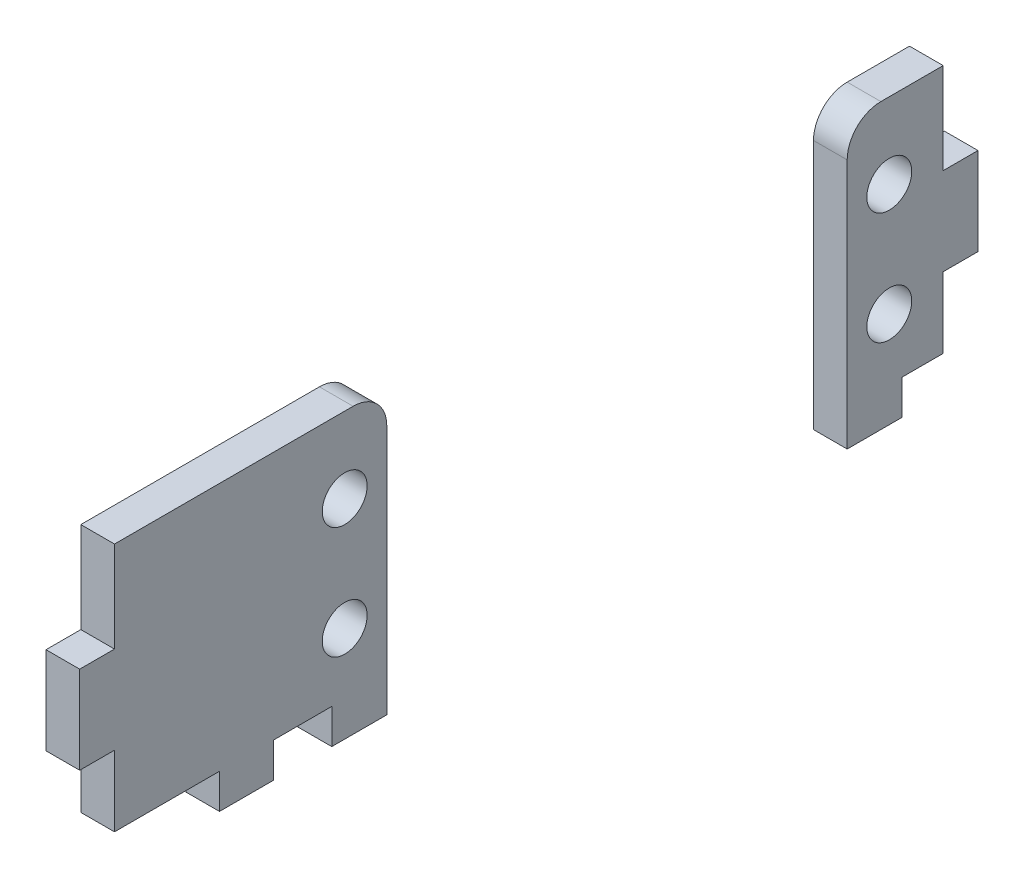
ISO-10303-21;
HEADER;
FILE_DESCRIPTION(('STEP AP214'),'2;1');
FILE_NAME('part.step','',(''),(''),'','','');
FILE_SCHEMA(('AUTOMOTIVE_DESIGN { 1 0 10303 214 1 1 1 1 }'));
ENDSEC;
DATA;
#1=APPLICATION_CONTEXT('core data for automotive mechanical design processes');
#2=APPLICATION_PROTOCOL_DEFINITION('international standard','automotive_design',2000,#1);
#3=PRODUCT_CONTEXT('',#1,'mechanical');
#4=PRODUCT('Part','Part','',(#3));
#5=PRODUCT_RELATED_PRODUCT_CATEGORY('part','',(#4));
#6=PRODUCT_DEFINITION_FORMATION('','',#4);
#7=PRODUCT_DEFINITION_CONTEXT('part definition',#1,'design');
#8=PRODUCT_DEFINITION('design','',#6,#7);
#9=PRODUCT_DEFINITION_SHAPE('','',#8);
#10=(LENGTH_UNIT() NAMED_UNIT(*) SI_UNIT(.MILLI.,.METRE.));
#11=(NAMED_UNIT(*) PLANE_ANGLE_UNIT() SI_UNIT($,.RADIAN.));
#12=(NAMED_UNIT(*) SI_UNIT($,.STERADIAN.) SOLID_ANGLE_UNIT());
#13=UNCERTAINTY_MEASURE_WITH_UNIT(LENGTH_MEASURE(1.E-05),#10,'distance_accuracy_value','');
#14=(GEOMETRIC_REPRESENTATION_CONTEXT(3) GLOBAL_UNCERTAINTY_ASSIGNED_CONTEXT((#13)) GLOBAL_UNIT_ASSIGNED_CONTEXT((#10,
#11,#12)) REPRESENTATION_CONTEXT('',''));
#15=CARTESIAN_POINT('',(0.,0.,0.));
#16=DIRECTION('',(0.,0.,1.));
#17=DIRECTION('',(1.,0.,0.));
#18=AXIS2_PLACEMENT_3D('',#15,#16,#17);
#19=CARTESIAN_POINT('',(-3.00000000000004,-25.3,-80.));
#20=DIRECTION('',(0.,-1.,0.));
#21=DIRECTION('',(0.,0.,-1.));
#22=AXIS2_PLACEMENT_3D('',#19,#20,#21);
#23=PLANE('',#22);
#24=DIRECTION('',(-1.,0.,0.));
#25=VECTOR('',#24,1.);
#26=CARTESIAN_POINT('',(-3.00000000000004,-25.3,-73.25));
#27=LINE('',#26,#25);
#28=CARTESIAN_POINT('',(0.,-25.3,-73.25));
#29=VERTEX_POINT('',#28);
#30=CARTESIAN_POINT('',(-3.00000000000004,-25.3,-73.25));
#31=VERTEX_POINT('',#30);
#32=EDGE_CURVE('E133',#29,#31,#27,.T.);
#33=ORIENTED_EDGE('',*,*,#32,.F.);
#34=DIRECTION('',(0.,0.,-1.));
#35=VECTOR('',#34,1.);
#36=CARTESIAN_POINT('',(0.,-25.3,-80.));
#37=LINE('',#36,#35);
#38=CARTESIAN_POINT('',(0.,-25.3,-68.35));
#39=VERTEX_POINT('',#38);
#40=EDGE_CURVE('E195',#39,#29,#37,.T.);
#41=ORIENTED_EDGE('',*,*,#40,.F.);
#42=DIRECTION('',(1.,0.,0.));
#43=VECTOR('',#42,1.);
#44=CARTESIAN_POINT('',(-3.00000000000004,-25.3,-68.35));
#45=LINE('',#44,#43);
#46=CARTESIAN_POINT('',(-3.00000000000004,-25.3,-68.35));
#47=VERTEX_POINT('',#46);
#48=EDGE_CURVE('E207',#47,#39,#45,.T.);
#49=ORIENTED_EDGE('',*,*,#48,.F.);
#50=DIRECTION('',(0.,0.,-1.));
#51=VECTOR('',#50,1.);
#52=CARTESIAN_POINT('',(-3.00000000000004,-25.3,-80.));
#53=LINE('',#52,#51);
#54=EDGE_CURVE('E198',#47,#31,#53,.T.);
#55=ORIENTED_EDGE('',*,*,#54,.T.);
#56=EDGE_LOOP('',(#33,#41,#49,#55));
#57=FACE_BOUND('',#56,.T.);
#58=ADVANCED_FACE('F43',(#57),#23,.T.);
#59=CARTESIAN_POINT('',(-3.00000000000004,0.,-68.35));
#60=DIRECTION('',(0.,0.,1.));
#61=DIRECTION('',(1.,0.,0.));
#62=AXIS2_PLACEMENT_3D('',#59,#60,#61);
#63=PLANE('',#62);
#64=DIRECTION('',(0.,-1.,0.));
#65=VECTOR('',#64,1.);
#66=CARTESIAN_POINT('',(0.,0.,-68.35));
#67=LINE('',#66,#65);
#68=CARTESIAN_POINT('',(0.,-3.,-68.35));
#69=VERTEX_POINT('',#68);
#70=EDGE_CURVE('E202',#69,#39,#67,.T.);
#71=ORIENTED_EDGE('',*,*,#70,.F.);
#72=DIRECTION('',(1.,0.,0.));
#73=VECTOR('',#72,1.);
#74=CARTESIAN_POINT('',(-3.00000000000004,-3.,-68.35));
#75=LINE('',#74,#73);
#76=CARTESIAN_POINT('',(-3.00000000000004,-3.,-68.35));
#77=VERTEX_POINT('',#76);
#78=EDGE_CURVE('E51',#69,#77,#75,.F.);
#79=ORIENTED_EDGE('',*,*,#78,.T.);
#80=DIRECTION('',(0.,-1.,0.));
#81=VECTOR('',#80,1.);
#82=CARTESIAN_POINT('',(-3.00000000000004,0.,-68.35));
#83=LINE('',#82,#81);
#84=EDGE_CURVE('E205',#77,#47,#83,.T.);
#85=ORIENTED_EDGE('',*,*,#84,.T.);
#86=ORIENTED_EDGE('',*,*,#48,.T.);
#87=EDGE_LOOP('',(#71,#79,#85,#86));
#88=FACE_BOUND('',#87,.T.);
#89=ADVANCED_FACE('F255',(#88),#63,.T.);
#90=CARTESIAN_POINT('',(-3.00000000000004,0.,-68.35));
#91=DIRECTION('',(0.,1.,0.));
#92=DIRECTION('',(0.,0.,1.));
#93=AXIS2_PLACEMENT_3D('',#90,#91,#92);
#94=PLANE('',#93);
#95=DIRECTION('',(0.,0.,1.));
#96=VECTOR('',#95,1.);
#97=CARTESIAN_POINT('',(-3.00000000000004,0.,-68.35));
#98=LINE('',#97,#96);
#99=CARTESIAN_POINT('',(-3.00000000000004,0.,-76.9));
#100=VERTEX_POINT('',#99);
#101=CARTESIAN_POINT('',(-3.00000000000004,0.,-71.35));
#102=VERTEX_POINT('',#101);
#103=EDGE_CURVE('E148',#100,#102,#98,.T.);
#104=ORIENTED_EDGE('',*,*,#103,.T.);
#105=DIRECTION('',(1.,0.,0.));
#106=VECTOR('',#105,1.);
#107=CARTESIAN_POINT('',(-3.00000000000004,0.,-71.35));
#108=LINE('',#107,#106);
#109=CARTESIAN_POINT('',(0.,0.,-71.35));
#110=VERTEX_POINT('',#109);
#111=EDGE_CURVE('E222',#102,#110,#108,.T.);
#112=ORIENTED_EDGE('',*,*,#111,.T.);
#113=DIRECTION('',(0.,0.,1.));
#114=VECTOR('',#113,1.);
#115=CARTESIAN_POINT('',(0.,0.,-68.35));
#116=LINE('',#115,#114);
#117=CARTESIAN_POINT('',(0.,0.,-76.9));
#118=VERTEX_POINT('',#117);
#119=EDGE_CURVE('E213',#118,#110,#116,.T.);
#120=ORIENTED_EDGE('',*,*,#119,.F.);
#121=DIRECTION('',(1.,0.,0.));
#122=VECTOR('',#121,1.);
#123=CARTESIAN_POINT('',(-3.00000000000004,0.,-76.9));
#124=LINE('',#123,#122);
#125=EDGE_CURVE('E182',#100,#118,#124,.T.);
#126=ORIENTED_EDGE('',*,*,#125,.F.);
#127=EDGE_LOOP('',(#104,#112,#120,#126));
#128=FACE_BOUND('',#127,.T.);
#129=ADVANCED_FACE('F228',(#128),#94,.T.);
#130=CARTESIAN_POINT('',(-3.00000000000004,0.,-80.));
#131=DIRECTION('',(0.,0.,-1.));
#132=DIRECTION('',(-1.,0.,0.));
#133=AXIS2_PLACEMENT_3D('',#130,#131,#132);
#134=PLANE('',#133);
#135=DIRECTION('',(-1.,0.,0.));
#136=VECTOR('',#135,1.);
#137=CARTESIAN_POINT('',(-3.00000000000004,-8.10000000000002,-80.));
#138=LINE('',#137,#136);
#139=CARTESIAN_POINT('',(0.,-8.10000000000002,-80.));
#140=VERTEX_POINT('',#139);
#141=CARTESIAN_POINT('',(-3.00000000000004,-8.10000000000002,-80.));
#142=VERTEX_POINT('',#141);
#143=EDGE_CURVE('E139',#140,#142,#138,.T.);
#144=ORIENTED_EDGE('',*,*,#143,.F.);
#145=DIRECTION('',(0.,1.,0.));
#146=VECTOR('',#145,1.);
#147=CARTESIAN_POINT('',(0.,0.,-80.));
#148=LINE('',#147,#146);
#149=CARTESIAN_POINT('',(0.,-15.9,-80.));
#150=VERTEX_POINT('',#149);
#151=EDGE_CURVE('E210',#150,#140,#148,.T.);
#152=ORIENTED_EDGE('',*,*,#151,.F.);
#153=DIRECTION('',(1.,0.,0.));
#154=VECTOR('',#153,1.);
#155=CARTESIAN_POINT('',(-3.00000000000004,-15.9,-80.));
#156=LINE('',#155,#154);
#157=CARTESIAN_POINT('',(-3.00000000000004,-15.9,-80.));
#158=VERTEX_POINT('',#157);
#159=EDGE_CURVE('E180',#158,#150,#156,.T.);
#160=ORIENTED_EDGE('',*,*,#159,.F.);
#161=DIRECTION('',(0.,1.,0.));
#162=VECTOR('',#161,1.);
#163=CARTESIAN_POINT('',(-3.00000000000004,0.,-80.));
#164=LINE('',#163,#162);
#165=EDGE_CURVE('E201',#158,#142,#164,.T.);
#166=ORIENTED_EDGE('',*,*,#165,.T.);
#167=EDGE_LOOP('',(#144,#152,#160,#166));
#168=FACE_BOUND('',#167,.T.);
#169=ADVANCED_FACE('F236',(#168),#134,.T.);
#170=CARTESIAN_POINT('',(-3.00000000000004,0.,0.));
#171=DIRECTION('',(1.,0.,0.));
#172=DIRECTION('',(0.,0.,-1.));
#173=AXIS2_PLACEMENT_3D('',#170,#171,#172);
#174=PLANE('',#173);
#175=ORIENTED_EDGE('',*,*,#84,.F.);
#176=CARTESIAN_POINT('',(-3.00000000000004,-3.,-71.35));
#177=DIRECTION('',(1.,0.,0.));
#178=DIRECTION('',(0.,0.,-1.));
#179=AXIS2_PLACEMENT_3D('',#176,#177,#178);
#180=CIRCLE('',#179,3.);
#181=EDGE_CURVE('E12',#77,#102,#180,.F.);
#182=ORIENTED_EDGE('',*,*,#181,.T.);
#183=ORIENTED_EDGE('',*,*,#103,.F.);
#184=DIRECTION('',(0.,-1.,0.));
#185=VECTOR('',#184,1.);
#186=CARTESIAN_POINT('',(-3.00000000000004,0.100000000000007,-76.9));
#187=LINE('',#186,#185);
#188=CARTESIAN_POINT('',(-3.00000000000004,-8.10000000000002,-76.9));
#189=VERTEX_POINT('',#188);
#190=EDGE_CURVE('E127',#100,#189,#187,.T.);
#191=ORIENTED_EDGE('',*,*,#190,.T.);
#192=DIRECTION('',(0.,0.,-1.));
#193=VECTOR('',#192,1.);
#194=CARTESIAN_POINT('',(-3.00000000000004,-8.10000000000002,-76.9));
#195=LINE('',#194,#193);
#196=EDGE_CURVE('E134',#189,#142,#195,.T.);
#197=ORIENTED_EDGE('',*,*,#196,.T.);
#198=ORIENTED_EDGE('',*,*,#165,.F.);
#199=DIRECTION('',(0.,0.,1.));
#200=VECTOR('',#199,1.);
#201=CARTESIAN_POINT('',(-3.00000000000004,-15.9,-80.1000000000001));
#202=LINE('',#201,#200);
#203=CARTESIAN_POINT('',(-3.00000000000004,-15.9,-76.9));
#204=VERTEX_POINT('',#203);
#205=EDGE_CURVE('E154',#158,#204,#202,.T.);
#206=ORIENTED_EDGE('',*,*,#205,.T.);
#207=DIRECTION('',(0.,-1.,0.));
#208=VECTOR('',#207,1.);
#209=CARTESIAN_POINT('',(-3.00000000000004,-15.9,-76.9));
#210=LINE('',#209,#208);
#211=CARTESIAN_POINT('',(-3.00000000000004,-22.2,-76.9));
#212=VERTEX_POINT('',#211);
#213=EDGE_CURVE('E157',#204,#212,#210,.T.);
#214=ORIENTED_EDGE('',*,*,#213,.T.);
#215=DIRECTION('',(0.,0.,1.));
#216=VECTOR('',#215,1.);
#217=CARTESIAN_POINT('',(-3.00000000000004,-22.2,-76.9));
#218=LINE('',#217,#216);
#219=CARTESIAN_POINT('',(-3.00000000000004,-22.2,-73.25));
#220=VERTEX_POINT('',#219);
#221=EDGE_CURVE('E161',#212,#220,#218,.T.);
#222=ORIENTED_EDGE('',*,*,#221,.T.);
#223=DIRECTION('',(0.,-1.,0.));
#224=VECTOR('',#223,1.);
#225=CARTESIAN_POINT('',(-3.00000000000004,-22.2,-73.25));
#226=LINE('',#225,#224);
#227=EDGE_CURVE('E164',#220,#31,#226,.T.);
#228=ORIENTED_EDGE('',*,*,#227,.T.);
#229=ORIENTED_EDGE('',*,*,#54,.F.);
#230=EDGE_LOOP('',(#175,#182,#183,#191,#197,#198,#206,#214,#222,#228,#229));
#231=FACE_BOUND('',#230,.T.);
#232=CARTESIAN_POINT('',(-3.00000000000004,-16.75,-72.1000000000001));
#233=DIRECTION('',(1.,0.,0.));
#234=DIRECTION('',(0.,0.,-1.));
#235=AXIS2_PLACEMENT_3D('',#232,#233,#234);
#236=CIRCLE('',#235,2.);
#237=CARTESIAN_POINT('',(-3.00000000000004,-16.75,-74.1000000000001));
#238=VERTEX_POINT('',#237);
#239=EDGE_CURVE('E186',#238,#238,#236,.T.);
#240=ORIENTED_EDGE('',*,*,#239,.T.);
#241=EDGE_LOOP('',(#240));
#242=FACE_BOUND('',#241,.T.);
#243=CARTESIAN_POINT('',(-3.00000000000004,-6.74999999999998,-72.1000000000001));
#244=DIRECTION('',(1.,0.,0.));
#245=DIRECTION('',(0.,0.,-1.));
#246=AXIS2_PLACEMENT_3D('',#243,#244,#245);
#247=CIRCLE('',#246,2.);
#248=CARTESIAN_POINT('',(-3.00000000000004,-6.74999999999998,-74.1000000000001));
#249=VERTEX_POINT('',#248);
#250=EDGE_CURVE('E192',#249,#249,#247,.T.);
#251=ORIENTED_EDGE('',*,*,#250,.T.);
#252=EDGE_LOOP('',(#251));
#253=FACE_BOUND('',#252,.T.);
#254=ADVANCED_FACE('F145',(#231,#242,#253),#174,.F.);
#255=CARTESIAN_POINT('',(0.,0.,0.));
#256=DIRECTION('',(1.,0.,0.));
#257=DIRECTION('',(0.,0.,-1.));
#258=AXIS2_PLACEMENT_3D('',#255,#256,#257);
#259=PLANE('',#258);
#260=ORIENTED_EDGE('',*,*,#119,.T.);
#261=CARTESIAN_POINT('',(0.,-3.,-71.35));
#262=DIRECTION('',(1.,0.,0.));
#263=DIRECTION('',(0.,0.,-1.));
#264=AXIS2_PLACEMENT_3D('',#261,#262,#263);
#265=CIRCLE('',#264,3.);
#266=EDGE_CURVE('E65',#110,#69,#265,.T.);
#267=ORIENTED_EDGE('',*,*,#266,.T.);
#268=ORIENTED_EDGE('',*,*,#70,.T.);
#269=ORIENTED_EDGE('',*,*,#40,.T.);
#270=DIRECTION('',(0.,-1.,0.));
#271=VECTOR('',#270,1.);
#272=CARTESIAN_POINT('',(0.,-22.2,-73.25));
#273=LINE('',#272,#271);
#274=CARTESIAN_POINT('',(0.,-22.2,-73.25));
#275=VERTEX_POINT('',#274);
#276=EDGE_CURVE('E158',#275,#29,#273,.T.);
#277=ORIENTED_EDGE('',*,*,#276,.F.);
#278=DIRECTION('',(0.,0.,1.));
#279=VECTOR('',#278,1.);
#280=CARTESIAN_POINT('',(0.,-22.2,-76.9));
#281=LINE('',#280,#279);
#282=CARTESIAN_POINT('',(0.,-22.2,-76.9));
#283=VERTEX_POINT('',#282);
#284=EDGE_CURVE('E171',#283,#275,#281,.T.);
#285=ORIENTED_EDGE('',*,*,#284,.F.);
#286=DIRECTION('',(0.,-1.,0.));
#287=VECTOR('',#286,1.);
#288=CARTESIAN_POINT('',(0.,-15.9,-76.9));
#289=LINE('',#288,#287);
#290=CARTESIAN_POINT('',(0.,-15.9,-76.9));
#291=VERTEX_POINT('',#290);
#292=EDGE_CURVE('E168',#291,#283,#289,.T.);
#293=ORIENTED_EDGE('',*,*,#292,.F.);
#294=DIRECTION('',(0.,0.,1.));
#295=VECTOR('',#294,1.);
#296=CARTESIAN_POINT('',(0.,-15.9,0.));
#297=LINE('',#296,#295);
#298=EDGE_CURVE('E218',#150,#291,#297,.T.);
#299=ORIENTED_EDGE('',*,*,#298,.F.);
#300=ORIENTED_EDGE('',*,*,#151,.T.);
#301=DIRECTION('',(0.,0.,-1.));
#302=VECTOR('',#301,1.);
#303=CARTESIAN_POINT('',(0.,-8.10000000000002,-76.9));
#304=LINE('',#303,#302);
#305=CARTESIAN_POINT('',(0.,-8.10000000000002,-76.9));
#306=VERTEX_POINT('',#305);
#307=EDGE_CURVE('E149',#306,#140,#304,.T.);
#308=ORIENTED_EDGE('',*,*,#307,.F.);
#309=DIRECTION('',(0.,-1.,0.));
#310=VECTOR('',#309,1.);
#311=CARTESIAN_POINT('',(0.,0.,-76.9));
#312=LINE('',#311,#310);
#313=EDGE_CURVE('E130',#118,#306,#312,.T.);
#314=ORIENTED_EDGE('',*,*,#313,.F.);
#315=EDGE_LOOP('',(#260,#267,#268,#269,#277,#285,#293,#299,#300,#308,#314));
#316=FACE_BOUND('',#315,.T.);
#317=CARTESIAN_POINT('',(0.,-16.75,-72.1000000000001));
#318=DIRECTION('',(1.,0.,0.));
#319=DIRECTION('',(0.,0.,-1.));
#320=AXIS2_PLACEMENT_3D('',#317,#318,#319);
#321=CIRCLE('',#320,2.);
#322=CARTESIAN_POINT('',(0.,-16.75,-74.1000000000001));
#323=VERTEX_POINT('',#322);
#324=EDGE_CURVE('E185',#323,#323,#321,.T.);
#325=ORIENTED_EDGE('',*,*,#324,.F.);
#326=EDGE_LOOP('',(#325));
#327=FACE_BOUND('',#326,.T.);
#328=CARTESIAN_POINT('',(0.,-6.74999999999998,-72.1000000000001));
#329=DIRECTION('',(1.,0.,0.));
#330=DIRECTION('',(0.,0.,-1.));
#331=AXIS2_PLACEMENT_3D('',#328,#329,#330);
#332=CIRCLE('',#331,2.);
#333=CARTESIAN_POINT('',(0.,-6.74999999999998,-74.1000000000001));
#334=VERTEX_POINT('',#333);
#335=EDGE_CURVE('E189',#334,#334,#332,.T.);
#336=ORIENTED_EDGE('',*,*,#335,.F.);
#337=EDGE_LOOP('',(#336));
#338=FACE_BOUND('',#337,.T.);
#339=ADVANCED_FACE('F231',(#316,#327,#338),#259,.T.);
#340=CARTESIAN_POINT('',(-3.00000000000004,-6.74999999999998,-72.1000000000001));
#341=DIRECTION('',(1.,0.,0.));
#342=DIRECTION('',(0.,0.,-1.));
#343=AXIS2_PLACEMENT_3D('',#340,#341,#342);
#344=CYLINDRICAL_SURFACE('',#343,2.);
#345=ORIENTED_EDGE('',*,*,#250,.F.);
#346=EDGE_LOOP('',(#345));
#347=FACE_BOUND('',#346,.T.);
#348=ORIENTED_EDGE('',*,*,#335,.T.);
#349=EDGE_LOOP('',(#348));
#350=FACE_BOUND('',#349,.T.);
#351=ADVANCED_FACE('F273',(#347,#350),#344,.F.);
#352=CARTESIAN_POINT('',(-3.00000000000004,-16.75,-72.1000000000001));
#353=DIRECTION('',(1.,0.,0.));
#354=DIRECTION('',(0.,0.,-1.));
#355=AXIS2_PLACEMENT_3D('',#352,#353,#354);
#356=CYLINDRICAL_SURFACE('',#355,2.);
#357=ORIENTED_EDGE('',*,*,#239,.F.);
#358=EDGE_LOOP('',(#357));
#359=FACE_BOUND('',#358,.T.);
#360=ORIENTED_EDGE('',*,*,#324,.T.);
#361=EDGE_LOOP('',(#360));
#362=FACE_BOUND('',#361,.T.);
#363=ADVANCED_FACE('F278',(#359,#362),#356,.F.);
#364=CARTESIAN_POINT('',(-3.00000000000004,-15.9,-80.1000000000001));
#365=DIRECTION('',(0.,1.,0.));
#366=DIRECTION('',(0.,0.,1.));
#367=AXIS2_PLACEMENT_3D('',#364,#365,#366);
#368=PLANE('',#367);
#369=ORIENTED_EDGE('',*,*,#159,.T.);
#370=ORIENTED_EDGE('',*,*,#298,.T.);
#371=DIRECTION('',(1.,0.,0.));
#372=VECTOR('',#371,1.);
#373=CARTESIAN_POINT('',(-3.00000000000004,-15.9,-76.9));
#374=LINE('',#373,#372);
#375=EDGE_CURVE('E167',#204,#291,#374,.T.);
#376=ORIENTED_EDGE('',*,*,#375,.F.);
#377=ORIENTED_EDGE('',*,*,#205,.F.);
#378=EDGE_LOOP('',(#369,#370,#376,#377));
#379=FACE_BOUND('',#378,.T.);
#380=ADVANCED_FACE('F240',(#379),#368,.F.);
#381=CARTESIAN_POINT('',(-3.00000000000004,-22.2,-73.25));
#382=DIRECTION('',(0.,0.,1.));
#383=DIRECTION('',(1.,0.,0.));
#384=AXIS2_PLACEMENT_3D('',#381,#382,#383);
#385=PLANE('',#384);
#386=ORIENTED_EDGE('',*,*,#32,.T.);
#387=ORIENTED_EDGE('',*,*,#227,.F.);
#388=DIRECTION('',(1.,0.,0.));
#389=VECTOR('',#388,1.);
#390=CARTESIAN_POINT('',(-3.00000000000004,-22.2,-73.25));
#391=LINE('',#390,#389);
#392=EDGE_CURVE('E151',#220,#275,#391,.T.);
#393=ORIENTED_EDGE('',*,*,#392,.T.);
#394=ORIENTED_EDGE('',*,*,#276,.T.);
#395=EDGE_LOOP('',(#386,#387,#393,#394));
#396=FACE_BOUND('',#395,.T.);
#397=ADVANCED_FACE('F285',(#396),#385,.F.);
#398=CARTESIAN_POINT('',(-3.00000000000004,-22.2,-76.9));
#399=DIRECTION('',(0.,1.,0.));
#400=DIRECTION('',(0.,0.,1.));
#401=AXIS2_PLACEMENT_3D('',#398,#399,#400);
#402=PLANE('',#401);
#403=ORIENTED_EDGE('',*,*,#284,.T.);
#404=ORIENTED_EDGE('',*,*,#392,.F.);
#405=ORIENTED_EDGE('',*,*,#221,.F.);
#406=DIRECTION('',(1.,0.,0.));
#407=VECTOR('',#406,1.);
#408=CARTESIAN_POINT('',(-3.00000000000004,-22.2,-76.9));
#409=LINE('',#408,#407);
#410=EDGE_CURVE('E176',#212,#283,#409,.T.);
#411=ORIENTED_EDGE('',*,*,#410,.T.);
#412=EDGE_LOOP('',(#403,#404,#405,#411));
#413=FACE_BOUND('',#412,.T.);
#414=ADVANCED_FACE('F247',(#413),#402,.F.);
#415=CARTESIAN_POINT('',(-3.00000000000004,-15.9,-76.9));
#416=DIRECTION('',(0.,0.,1.));
#417=DIRECTION('',(1.,0.,0.));
#418=AXIS2_PLACEMENT_3D('',#415,#416,#417);
#419=PLANE('',#418);
#420=ORIENTED_EDGE('',*,*,#292,.T.);
#421=ORIENTED_EDGE('',*,*,#410,.F.);
#422=ORIENTED_EDGE('',*,*,#213,.F.);
#423=ORIENTED_EDGE('',*,*,#375,.T.);
#424=EDGE_LOOP('',(#420,#421,#422,#423));
#425=FACE_BOUND('',#424,.T.);
#426=ADVANCED_FACE('F243',(#425),#419,.F.);
#427=CARTESIAN_POINT('',(-3.00000000000004,-8.10000000000002,-76.9));
#428=DIRECTION('',(0.,-1.,0.));
#429=DIRECTION('',(0.,0.,-1.));
#430=AXIS2_PLACEMENT_3D('',#427,#428,#429);
#431=PLANE('',#430);
#432=ORIENTED_EDGE('',*,*,#143,.T.);
#433=ORIENTED_EDGE('',*,*,#196,.F.);
#434=DIRECTION('',(1.,0.,0.));
#435=VECTOR('',#434,1.);
#436=CARTESIAN_POINT('',(-3.00000000000004,-8.10000000000002,-76.9));
#437=LINE('',#436,#435);
#438=EDGE_CURVE('E123',#189,#306,#437,.T.);
#439=ORIENTED_EDGE('',*,*,#438,.T.);
#440=ORIENTED_EDGE('',*,*,#307,.T.);
#441=EDGE_LOOP('',(#432,#433,#439,#440));
#442=FACE_BOUND('',#441,.T.);
#443=ADVANCED_FACE('F137',(#442),#431,.F.);
#444=CARTESIAN_POINT('',(-3.00000000000004,0.100000000000007,-76.9));
#445=DIRECTION('',(0.,0.,1.));
#446=DIRECTION('',(1.,0.,0.));
#447=AXIS2_PLACEMENT_3D('',#444,#445,#446);
#448=PLANE('',#447);
#449=ORIENTED_EDGE('',*,*,#125,.T.);
#450=ORIENTED_EDGE('',*,*,#313,.T.);
#451=ORIENTED_EDGE('',*,*,#438,.F.);
#452=ORIENTED_EDGE('',*,*,#190,.F.);
#453=EDGE_LOOP('',(#449,#450,#451,#452));
#454=FACE_BOUND('',#453,.T.);
#455=ADVANCED_FACE('F125',(#454),#448,.F.);
#456=CARTESIAN_POINT('',(-3.00000000000004,-3.,-71.35));
#457=DIRECTION('',(1.,0.,0.));
#458=DIRECTION('',(0.,0.,-1.));
#459=AXIS2_PLACEMENT_3D('',#456,#457,#458);
#460=CYLINDRICAL_SURFACE('',#459,3.);
#461=ORIENTED_EDGE('',*,*,#181,.F.);
#462=ORIENTED_EDGE('',*,*,#78,.F.);
#463=ORIENTED_EDGE('',*,*,#266,.F.);
#464=ORIENTED_EDGE('',*,*,#111,.F.);
#465=EDGE_LOOP('',(#461,#462,#463,#464));
#466=FACE_BOUND('',#465,.T.);
#467=ADVANCED_FACE('F45',(#466),#460,.T.);
#468=CLOSED_SHELL('',(#58,#89,#129,#169,#254,#339,#351,#363,#380,#397,#414,#426,#443,#455,#467));
#469=MANIFOLD_SOLID_BREP('B2',#468);
#470=CARTESIAN_POINT('',(-3.00000000000004,-25.3,-27.35));
#471=DIRECTION('',(0.,-1.,0.));
#472=DIRECTION('',(0.,0.,-1.));
#473=AXIS2_PLACEMENT_3D('',#470,#471,#472);
#474=PLANE('',#473);
#475=DIRECTION('',(1.,0.,0.));
#476=VECTOR('',#475,1.);
#477=CARTESIAN_POINT('',(-3.00000000000004,-25.3,-22.45));
#478=LINE('',#477,#476);
#479=CARTESIAN_POINT('',(-3.00000000000004,-25.3,-22.45));
#480=VERTEX_POINT('',#479);
#481=CARTESIAN_POINT('',(0.,-25.3,-22.45));
#482=VERTEX_POINT('',#481);
#483=EDGE_CURVE('E576',#480,#482,#478,.T.);
#484=ORIENTED_EDGE('',*,*,#483,.F.);
#485=DIRECTION('',(0.,0.,-1.));
#486=VECTOR('',#485,1.);
#487=CARTESIAN_POINT('',(-3.00000000000004,-25.3,-27.35));
#488=LINE('',#487,#486);
#489=CARTESIAN_POINT('',(-3.00000000000004,-25.3,-27.35));
#490=VERTEX_POINT('',#489);
#491=EDGE_CURVE('E597',#480,#490,#488,.T.);
#492=ORIENTED_EDGE('',*,*,#491,.T.);
#493=DIRECTION('',(1.,0.,0.));
#494=VECTOR('',#493,1.);
#495=CARTESIAN_POINT('',(-3.00000000000004,-25.3,-27.35));
#496=LINE('',#495,#494);
#497=CARTESIAN_POINT('',(0.,-25.3,-27.35));
#498=VERTEX_POINT('',#497);
#499=EDGE_CURVE('E603',#490,#498,#496,.T.);
#500=ORIENTED_EDGE('',*,*,#499,.T.);
#501=DIRECTION('',(0.,0.,-1.));
#502=VECTOR('',#501,1.);
#503=CARTESIAN_POINT('',(0.,-25.3,-27.35));
#504=LINE('',#503,#502);
#505=EDGE_CURVE('E608',#482,#498,#504,.T.);
#506=ORIENTED_EDGE('',*,*,#505,.F.);
#507=EDGE_LOOP('',(#484,#492,#500,#506));
#508=FACE_BOUND('',#507,.T.);
#509=ADVANCED_FACE('F391',(#508),#474,.T.);
#510=CARTESIAN_POINT('',(-3.00000000000004,0.,0.));
#511=DIRECTION('',(0.,1.,0.));
#512=DIRECTION('',(0.,0.,1.));
#513=AXIS2_PLACEMENT_3D('',#510,#511,#512);
#514=PLANE('',#513);
#515=DIRECTION('',(0.,0.,1.));
#516=VECTOR('',#515,1.);
#517=CARTESIAN_POINT('',(0.,0.,0.));
#518=LINE('',#517,#516);
#519=CARTESIAN_POINT('',(0.,0.,-24.35));
#520=VERTEX_POINT('',#519);
#521=CARTESIAN_POINT('',(0.,0.,-3.10000000000002));
#522=VERTEX_POINT('',#521);
#523=EDGE_CURVE('E588',#520,#522,#518,.T.);
#524=ORIENTED_EDGE('',*,*,#523,.F.);
#525=DIRECTION('',(1.,0.,0.));
#526=VECTOR('',#525,1.);
#527=CARTESIAN_POINT('',(-3.00000000000004,0.,-24.35));
#528=LINE('',#527,#526);
#529=CARTESIAN_POINT('',(-3.00000000000004,0.,-24.35));
#530=VERTEX_POINT('',#529);
#531=EDGE_CURVE('E399',#520,#530,#528,.F.);
#532=ORIENTED_EDGE('',*,*,#531,.T.);
#533=DIRECTION('',(0.,0.,1.));
#534=VECTOR('',#533,1.);
#535=CARTESIAN_POINT('',(-3.00000000000004,0.,0.));
#536=LINE('',#535,#534);
#537=CARTESIAN_POINT('',(-3.00000000000004,0.,-3.10000000000002));
#538=VERTEX_POINT('',#537);
#539=EDGE_CURVE('E591',#530,#538,#536,.T.);
#540=ORIENTED_EDGE('',*,*,#539,.T.);
#541=DIRECTION('',(-1.,0.,0.));
#542=VECTOR('',#541,1.);
#543=CARTESIAN_POINT('',(-3.00000000000004,0.,-3.10000000000002));
#544=LINE('',#543,#542);
#545=EDGE_CURVE('E570',#522,#538,#544,.T.);
#546=ORIENTED_EDGE('',*,*,#545,.F.);
#547=EDGE_LOOP('',(#524,#532,#540,#546));
#548=FACE_BOUND('',#547,.T.);
#549=ADVANCED_FACE('F645',(#548),#514,.T.);
#550=CARTESIAN_POINT('',(-3.00000000000004,0.,-27.35));
#551=DIRECTION('',(0.,0.,-1.));
#552=DIRECTION('',(0.,1.,0.));
#553=AXIS2_PLACEMENT_3D('',#550,#551,#552);
#554=PLANE('',#553);
#555=DIRECTION('',(0.,1.,0.));
#556=VECTOR('',#555,1.);
#557=CARTESIAN_POINT('',(-3.00000000000004,0.,-27.35));
#558=LINE('',#557,#556);
#559=CARTESIAN_POINT('',(-3.00000000000004,-3.,-27.35));
#560=VERTEX_POINT('',#559);
#561=EDGE_CURVE('E600',#490,#560,#558,.T.);
#562=ORIENTED_EDGE('',*,*,#561,.T.);
#563=DIRECTION('',(1.,0.,0.));
#564=VECTOR('',#563,1.);
#565=CARTESIAN_POINT('',(-3.00000000000004,-3.,-27.35));
#566=LINE('',#565,#564);
#567=CARTESIAN_POINT('',(0.,-3.,-27.35));
#568=VERTEX_POINT('',#567);
#569=EDGE_CURVE('E623',#560,#568,#566,.T.);
#570=ORIENTED_EDGE('',*,*,#569,.T.);
#571=DIRECTION('',(0.,1.,0.));
#572=VECTOR('',#571,1.);
#573=CARTESIAN_POINT('',(0.,0.,-27.35));
#574=LINE('',#573,#572);
#575=EDGE_CURVE('E594',#498,#568,#574,.T.);
#576=ORIENTED_EDGE('',*,*,#575,.F.);
#577=ORIENTED_EDGE('',*,*,#499,.F.);
#578=EDGE_LOOP('',(#562,#570,#576,#577));
#579=FACE_BOUND('',#578,.T.);
#580=ADVANCED_FACE('F629',(#579),#554,.T.);
#581=DIRECTION('',(-1.,0.,0.));
#582=VECTOR('',#581,1.);
#583=CARTESIAN_POINT('',(-3.00000000000004,-25.3,-17.25));
#584=LINE('',#583,#582);
#585=CARTESIAN_POINT('',(0.,-25.3,-17.25));
#586=VERTEX_POINT('',#585);
#587=CARTESIAN_POINT('',(-3.00000000000004,-25.3,-17.25));
#588=VERTEX_POINT('',#587);
#589=EDGE_CURVE('E514',#586,#588,#584,.T.);
#590=ORIENTED_EDGE('',*,*,#589,.F.);
#591=CARTESIAN_POINT('',(0.,-25.3,-12.45));
#592=VERTEX_POINT('',#591);
#593=EDGE_CURVE('E610',#592,#586,#504,.T.);
#594=ORIENTED_EDGE('',*,*,#593,.F.);
#595=DIRECTION('',(1.,0.,0.));
#596=VECTOR('',#595,1.);
#597=CARTESIAN_POINT('',(-3.00000000000004,-25.3,-12.45));
#598=LINE('',#597,#596);
#599=CARTESIAN_POINT('',(-3.00000000000004,-25.3,-12.45));
#600=VERTEX_POINT('',#599);
#601=EDGE_CURVE('E568',#600,#592,#598,.T.);
#602=ORIENTED_EDGE('',*,*,#601,.F.);
#603=EDGE_CURVE('E599',#600,#588,#488,.T.);
#604=ORIENTED_EDGE('',*,*,#603,.T.);
#605=EDGE_LOOP('',(#590,#594,#602,#604));
#606=FACE_BOUND('',#605,.T.);
#607=ADVANCED_FACE('F647',(#606),#474,.T.);
#608=CARTESIAN_POINT('',(-3.00000000000004,0.,0.));
#609=DIRECTION('',(0.,0.,1.));
#610=DIRECTION('',(0.,-1.,0.));
#611=AXIS2_PLACEMENT_3D('',#608,#609,#610);
#612=PLANE('',#611);
#613=DIRECTION('',(1.,0.,0.));
#614=VECTOR('',#613,1.);
#615=CARTESIAN_POINT('',(-3.00000000000004,-8.10000000000001,0.));
#616=LINE('',#615,#614);
#617=CARTESIAN_POINT('',(-3.00000000000004,-8.10000000000001,0.));
#618=VERTEX_POINT('',#617);
#619=CARTESIAN_POINT('',(0.,-8.10000000000001,0.));
#620=VERTEX_POINT('',#619);
#621=EDGE_CURVE('E573',#618,#620,#616,.T.);
#622=ORIENTED_EDGE('',*,*,#621,.F.);
#623=DIRECTION('',(0.,-1.,0.));
#624=VECTOR('',#623,1.);
#625=CARTESIAN_POINT('',(-3.00000000000004,0.,0.));
#626=LINE('',#625,#624);
#627=CARTESIAN_POINT('',(-3.00000000000004,-15.9,0.));
#628=VERTEX_POINT('',#627);
#629=EDGE_CURVE('E593',#618,#628,#626,.T.);
#630=ORIENTED_EDGE('',*,*,#629,.T.);
#631=DIRECTION('',(-1.,0.,0.));
#632=VECTOR('',#631,1.);
#633=CARTESIAN_POINT('',(-3.00000000000004,-15.9,0.));
#634=LINE('',#633,#632);
#635=CARTESIAN_POINT('',(0.,-15.9,0.));
#636=VERTEX_POINT('',#635);
#637=EDGE_CURVE('E529',#636,#628,#634,.T.);
#638=ORIENTED_EDGE('',*,*,#637,.F.);
#639=DIRECTION('',(0.,-1.,0.));
#640=VECTOR('',#639,1.);
#641=CARTESIAN_POINT('',(0.,0.,0.));
#642=LINE('',#641,#640);
#643=EDGE_CURVE('E605',#620,#636,#642,.T.);
#644=ORIENTED_EDGE('',*,*,#643,.F.);
#645=EDGE_LOOP('',(#622,#630,#638,#644));
#646=FACE_BOUND('',#645,.T.);
#647=ADVANCED_FACE('F654',(#646),#612,.T.);
#648=CARTESIAN_POINT('',(-3.00000000000004,0.,0.));
#649=DIRECTION('',(-1.,0.,0.));
#650=DIRECTION('',(0.,0.,1.));
#651=AXIS2_PLACEMENT_3D('',#648,#649,#650);
#652=PLANE('',#651);
#653=ORIENTED_EDGE('',*,*,#539,.F.);
#654=CARTESIAN_POINT('',(-3.00000000000004,-3.,-24.35));
#655=DIRECTION('',(-1.,0.,0.));
#656=DIRECTION('',(0.,0.,1.));
#657=AXIS2_PLACEMENT_3D('',#654,#655,#656);
#658=CIRCLE('',#657,3.);
#659=EDGE_CURVE('E41',#530,#560,#658,.T.);
#660=ORIENTED_EDGE('',*,*,#659,.T.);
#661=ORIENTED_EDGE('',*,*,#561,.F.);
#662=ORIENTED_EDGE('',*,*,#491,.F.);
#663=DIRECTION('',(0.,1.,0.));
#664=VECTOR('',#663,1.);
#665=CARTESIAN_POINT('',(-3.00000000000004,-25.4,-22.45));
#666=LINE('',#665,#664);
#667=CARTESIAN_POINT('',(-3.00000000000004,-22.2,-22.45));
#668=VERTEX_POINT('',#667);
#669=EDGE_CURVE('E508',#480,#668,#666,.T.);
#670=ORIENTED_EDGE('',*,*,#669,.T.);
#671=DIRECTION('',(0.,0.,1.));
#672=VECTOR('',#671,1.);
#673=CARTESIAN_POINT('',(-3.00000000000004,-22.2,-22.45));
#674=LINE('',#673,#672);
#675=CARTESIAN_POINT('',(-3.00000000000004,-22.2,-17.25));
#676=VERTEX_POINT('',#675);
#677=EDGE_CURVE('E501',#668,#676,#674,.T.);
#678=ORIENTED_EDGE('',*,*,#677,.T.);
#679=DIRECTION('',(0.,-1.,0.));
#680=VECTOR('',#679,1.);
#681=CARTESIAN_POINT('',(-3.00000000000004,-22.2,-17.25));
#682=LINE('',#681,#680);
#683=EDGE_CURVE('E511',#676,#588,#682,.T.);
#684=ORIENTED_EDGE('',*,*,#683,.T.);
#685=ORIENTED_EDGE('',*,*,#603,.F.);
#686=DIRECTION('',(0.,1.,0.));
#687=VECTOR('',#686,1.);
#688=CARTESIAN_POINT('',(-3.00000000000004,-25.4,-12.45));
#689=LINE('',#688,#687);
#690=CARTESIAN_POINT('',(-3.00000000000004,-22.2,-12.45));
#691=VERTEX_POINT('',#690);
#692=EDGE_CURVE('E542',#600,#691,#689,.T.);
#693=ORIENTED_EDGE('',*,*,#692,.T.);
#694=DIRECTION('',(0.,0.,1.));
#695=VECTOR('',#694,1.);
#696=CARTESIAN_POINT('',(-3.00000000000004,-22.2,-12.45));
#697=LINE('',#696,#695);
#698=CARTESIAN_POINT('',(-3.00000000000004,-22.2,-3.10000000000002));
#699=VERTEX_POINT('',#698);
#700=EDGE_CURVE('E545',#691,#699,#697,.T.);
#701=ORIENTED_EDGE('',*,*,#700,.T.);
#702=DIRECTION('',(0.,1.,0.));
#703=VECTOR('',#702,1.);
#704=CARTESIAN_POINT('',(-3.00000000000004,-22.2,-3.10000000000002));
#705=LINE('',#704,#703);
#706=CARTESIAN_POINT('',(-3.00000000000004,-15.9,-3.10000000000002));
#707=VERTEX_POINT('',#706);
#708=EDGE_CURVE('E549',#699,#707,#705,.T.);
#709=ORIENTED_EDGE('',*,*,#708,.T.);
#710=DIRECTION('',(0.,0.,1.));
#711=VECTOR('',#710,1.);
#712=CARTESIAN_POINT('',(-3.00000000000004,-15.9,-3.10000000000002));
#713=LINE('',#712,#711);
#714=EDGE_CURVE('E552',#707,#628,#713,.T.);
#715=ORIENTED_EDGE('',*,*,#714,.T.);
#716=ORIENTED_EDGE('',*,*,#629,.F.);
#717=DIRECTION('',(0.,0.,-1.));
#718=VECTOR('',#717,1.);
#719=CARTESIAN_POINT('',(-3.00000000000004,-8.10000000000001,0.1));
#720=LINE('',#719,#718);
#721=CARTESIAN_POINT('',(-3.00000000000004,-8.10000000000001,-3.10000000000002));
#722=VERTEX_POINT('',#721);
#723=EDGE_CURVE('E531',#618,#722,#720,.T.);
#724=ORIENTED_EDGE('',*,*,#723,.T.);
#725=DIRECTION('',(0.,1.,0.));
#726=VECTOR('',#725,1.);
#727=CARTESIAN_POINT('',(-3.00000000000004,-8.10000000000001,-3.10000000000002));
#728=LINE('',#727,#726);
#729=EDGE_CURVE('E534',#722,#538,#728,.T.);
#730=ORIENTED_EDGE('',*,*,#729,.T.);
#731=EDGE_LOOP('',(#653,#660,#661,#662,#670,#678,#684,#685,#693,#701,#709,#715,#716,#724,#730));
#732=FACE_BOUND('',#731,.T.);
#733=CARTESIAN_POINT('',(-3.00000000000004,-16.75,-23.6));
#734=DIRECTION('',(1.,0.,0.));
#735=DIRECTION('',(0.,0.,-1.));
#736=AXIS2_PLACEMENT_3D('',#733,#734,#735);
#737=CIRCLE('',#736,2.);
#738=CARTESIAN_POINT('',(-3.00000000000004,-16.75,-25.6));
#739=VERTEX_POINT('',#738);
#740=EDGE_CURVE('E579',#739,#739,#737,.T.);
#741=ORIENTED_EDGE('',*,*,#740,.T.);
#742=EDGE_LOOP('',(#741));
#743=FACE_BOUND('',#742,.T.);
#744=CARTESIAN_POINT('',(-3.00000000000004,-6.74999999999998,-23.6));
#745=DIRECTION('',(1.,0.,0.));
#746=DIRECTION('',(0.,0.,-1.));
#747=AXIS2_PLACEMENT_3D('',#744,#745,#746);
#748=CIRCLE('',#747,2.);
#749=CARTESIAN_POINT('',(-3.00000000000004,-6.74999999999998,-25.6));
#750=VERTEX_POINT('',#749);
#751=EDGE_CURVE('E585',#750,#750,#748,.T.);
#752=ORIENTED_EDGE('',*,*,#751,.T.);
#753=EDGE_LOOP('',(#752));
#754=FACE_BOUND('',#753,.T.);
#755=ADVANCED_FACE('F519',(#732,#743,#754),#652,.T.);
#756=CARTESIAN_POINT('',(0.,0.,0.));
#757=DIRECTION('',(-1.,0.,0.));
#758=DIRECTION('',(0.,0.,1.));
#759=AXIS2_PLACEMENT_3D('',#756,#757,#758);
#760=PLANE('',#759);
#761=CARTESIAN_POINT('',(0.,-16.75,-23.6));
#762=DIRECTION('',(1.,0.,0.));
#763=DIRECTION('',(0.,0.,-1.));
#764=AXIS2_PLACEMENT_3D('',#761,#762,#763);
#765=CIRCLE('',#764,2.);
#766=CARTESIAN_POINT('',(0.,-16.75,-25.6));
#767=VERTEX_POINT('',#766);
#768=EDGE_CURVE('E578',#767,#767,#765,.T.);
#769=ORIENTED_EDGE('',*,*,#768,.F.);
#770=EDGE_LOOP('',(#769));
#771=FACE_BOUND('',#770,.T.);
#772=CARTESIAN_POINT('',(0.,-6.74999999999998,-23.6));
#773=DIRECTION('',(1.,0.,0.));
#774=DIRECTION('',(0.,0.,-1.));
#775=AXIS2_PLACEMENT_3D('',#772,#773,#774);
#776=CIRCLE('',#775,2.);
#777=CARTESIAN_POINT('',(0.,-6.74999999999998,-25.6));
#778=VERTEX_POINT('',#777);
#779=EDGE_CURVE('E582',#778,#778,#776,.T.);
#780=ORIENTED_EDGE('',*,*,#779,.F.);
#781=EDGE_LOOP('',(#780));
#782=FACE_BOUND('',#781,.T.);
#783=ORIENTED_EDGE('',*,*,#575,.T.);
#784=CARTESIAN_POINT('',(0.,-3.,-24.35));
#785=DIRECTION('',(-1.,0.,0.));
#786=DIRECTION('',(0.,0.,1.));
#787=AXIS2_PLACEMENT_3D('',#784,#785,#786);
#788=CIRCLE('',#787,3.);
#789=EDGE_CURVE('E413',#568,#520,#788,.F.);
#790=ORIENTED_EDGE('',*,*,#789,.T.);
#791=ORIENTED_EDGE('',*,*,#523,.T.);
#792=DIRECTION('',(0.,1.,0.));
#793=VECTOR('',#792,1.);
#794=CARTESIAN_POINT('',(0.,-8.10000000000001,-3.10000000000002));
#795=LINE('',#794,#793);
#796=CARTESIAN_POINT('',(0.,-8.10000000000001,-3.10000000000002));
#797=VERTEX_POINT('',#796);
#798=EDGE_CURVE('E535',#797,#522,#795,.T.);
#799=ORIENTED_EDGE('',*,*,#798,.F.);
#800=DIRECTION('',(0.,0.,1.));
#801=VECTOR('',#800,1.);
#802=CARTESIAN_POINT('',(0.,-8.10000000000001,0.));
#803=LINE('',#802,#801);
#804=EDGE_CURVE('E617',#797,#620,#803,.T.);
#805=ORIENTED_EDGE('',*,*,#804,.T.);
#806=ORIENTED_EDGE('',*,*,#643,.T.);
#807=DIRECTION('',(0.,0.,1.));
#808=VECTOR('',#807,1.);
#809=CARTESIAN_POINT('',(0.,-15.9,-3.10000000000002));
#810=LINE('',#809,#808);
#811=CARTESIAN_POINT('',(0.,-15.9,-3.10000000000002));
#812=VERTEX_POINT('',#811);
#813=EDGE_CURVE('E546',#812,#636,#810,.T.);
#814=ORIENTED_EDGE('',*,*,#813,.F.);
#815=DIRECTION('',(0.,1.,0.));
#816=VECTOR('',#815,1.);
#817=CARTESIAN_POINT('',(0.,-22.2,-3.10000000000002));
#818=LINE('',#817,#816);
#819=CARTESIAN_POINT('',(0.,-22.2,-3.10000000000002));
#820=VERTEX_POINT('',#819);
#821=EDGE_CURVE('E559',#820,#812,#818,.T.);
#822=ORIENTED_EDGE('',*,*,#821,.F.);
#823=DIRECTION('',(0.,0.,1.));
#824=VECTOR('',#823,1.);
#825=CARTESIAN_POINT('',(0.,-22.2,-12.45));
#826=LINE('',#825,#824);
#827=CARTESIAN_POINT('',(0.,-22.2,-12.45));
#828=VERTEX_POINT('',#827);
#829=EDGE_CURVE('E556',#828,#820,#826,.T.);
#830=ORIENTED_EDGE('',*,*,#829,.F.);
#831=DIRECTION('',(0.,-1.,0.));
#832=VECTOR('',#831,1.);
#833=CARTESIAN_POINT('',(0.,0.,-12.45));
#834=LINE('',#833,#832);
#835=EDGE_CURVE('E614',#828,#592,#834,.T.);
#836=ORIENTED_EDGE('',*,*,#835,.T.);
#837=ORIENTED_EDGE('',*,*,#593,.T.);
#838=DIRECTION('',(0.,-1.,0.));
#839=VECTOR('',#838,1.);
#840=CARTESIAN_POINT('',(0.,-22.2,-17.25));
#841=LINE('',#840,#839);
#842=CARTESIAN_POINT('',(0.,-22.2,-17.25));
#843=VERTEX_POINT('',#842);
#844=EDGE_CURVE('E522',#843,#586,#841,.T.);
#845=ORIENTED_EDGE('',*,*,#844,.F.);
#846=DIRECTION('',(0.,0.,1.));
#847=VECTOR('',#846,1.);
#848=CARTESIAN_POINT('',(0.,-22.2,-22.45));
#849=LINE('',#848,#847);
#850=CARTESIAN_POINT('',(0.,-22.2,-22.45));
#851=VERTEX_POINT('',#850);
#852=EDGE_CURVE('E504',#851,#843,#849,.T.);
#853=ORIENTED_EDGE('',*,*,#852,.F.);
#854=DIRECTION('',(0.,-1.,0.));
#855=VECTOR('',#854,1.);
#856=CARTESIAN_POINT('',(0.,0.,-22.45));
#857=LINE('',#856,#855);
#858=EDGE_CURVE('E620',#851,#482,#857,.T.);
#859=ORIENTED_EDGE('',*,*,#858,.T.);
#860=ORIENTED_EDGE('',*,*,#505,.T.);
#861=EDGE_LOOP('',(#783,#790,#791,#799,#805,#806,#814,#822,#830,#836,#837,#845,#853,#859,#860));
#862=FACE_BOUND('',#861,.T.);
#863=ADVANCED_FACE('F634',(#771,#782,#862),#760,.F.);
#864=CARTESIAN_POINT('',(-3.00000000000004,-6.74999999999998,-23.6));
#865=DIRECTION('',(1.,0.,0.));
#866=DIRECTION('',(0.,0.,-1.));
#867=AXIS2_PLACEMENT_3D('',#864,#865,#866);
#868=CYLINDRICAL_SURFACE('',#867,2.);
#869=ORIENTED_EDGE('',*,*,#751,.F.);
#870=EDGE_LOOP('',(#869));
#871=FACE_BOUND('',#870,.T.);
#872=ORIENTED_EDGE('',*,*,#779,.T.);
#873=EDGE_LOOP('',(#872));
#874=FACE_BOUND('',#873,.T.);
#875=ADVANCED_FACE('F711',(#871,#874),#868,.F.);
#876=CARTESIAN_POINT('',(-3.00000000000004,-16.75,-23.6));
#877=DIRECTION('',(1.,0.,0.));
#878=DIRECTION('',(0.,0.,-1.));
#879=AXIS2_PLACEMENT_3D('',#876,#877,#878);
#880=CYLINDRICAL_SURFACE('',#879,2.);
#881=ORIENTED_EDGE('',*,*,#740,.F.);
#882=EDGE_LOOP('',(#881));
#883=FACE_BOUND('',#882,.T.);
#884=ORIENTED_EDGE('',*,*,#768,.T.);
#885=EDGE_LOOP('',(#884));
#886=FACE_BOUND('',#885,.T.);
#887=ADVANCED_FACE('F708',(#883,#886),#880,.F.);
#888=CARTESIAN_POINT('',(-3.00000000000004,-25.4,-12.45));
#889=DIRECTION('',(0.,0.,-1.));
#890=DIRECTION('',(-1.,0.,0.));
#891=AXIS2_PLACEMENT_3D('',#888,#889,#890);
#892=PLANE('',#891);
#893=ORIENTED_EDGE('',*,*,#601,.T.);
#894=ORIENTED_EDGE('',*,*,#835,.F.);
#895=DIRECTION('',(1.,0.,0.));
#896=VECTOR('',#895,1.);
#897=CARTESIAN_POINT('',(-3.00000000000004,-22.2,-12.45));
#898=LINE('',#897,#896);
#899=EDGE_CURVE('E555',#691,#828,#898,.T.);
#900=ORIENTED_EDGE('',*,*,#899,.F.);
#901=ORIENTED_EDGE('',*,*,#692,.F.);
#902=EDGE_LOOP('',(#893,#894,#900,#901));
#903=FACE_BOUND('',#902,.T.);
#904=ADVANCED_FACE('F668',(#903),#892,.F.);
#905=CARTESIAN_POINT('',(-3.00000000000004,-15.9,-3.10000000000002));
#906=DIRECTION('',(0.,1.,0.));
#907=DIRECTION('',(0.,0.,1.));
#908=AXIS2_PLACEMENT_3D('',#905,#906,#907);
#909=PLANE('',#908);
#910=ORIENTED_EDGE('',*,*,#637,.T.);
#911=ORIENTED_EDGE('',*,*,#714,.F.);
#912=DIRECTION('',(1.,0.,0.));
#913=VECTOR('',#912,1.);
#914=CARTESIAN_POINT('',(-3.00000000000004,-15.9,-3.10000000000002));
#915=LINE('',#914,#913);
#916=EDGE_CURVE('E540',#707,#812,#915,.T.);
#917=ORIENTED_EDGE('',*,*,#916,.T.);
#918=ORIENTED_EDGE('',*,*,#813,.T.);
#919=EDGE_LOOP('',(#910,#911,#917,#918));
#920=FACE_BOUND('',#919,.T.);
#921=ADVANCED_FACE('F678',(#920),#909,.F.);
#922=CARTESIAN_POINT('',(-3.00000000000004,-22.2,-3.10000000000002));
#923=DIRECTION('',(0.,0.,-1.));
#924=DIRECTION('',(-1.,0.,0.));
#925=AXIS2_PLACEMENT_3D('',#922,#923,#924);
#926=PLANE('',#925);
#927=ORIENTED_EDGE('',*,*,#821,.T.);
#928=ORIENTED_EDGE('',*,*,#916,.F.);
#929=ORIENTED_EDGE('',*,*,#708,.F.);
#930=DIRECTION('',(1.,0.,0.));
#931=VECTOR('',#930,1.);
#932=CARTESIAN_POINT('',(-3.00000000000004,-22.2,-3.10000000000002));
#933=LINE('',#932,#931);
#934=EDGE_CURVE('E564',#699,#820,#933,.T.);
#935=ORIENTED_EDGE('',*,*,#934,.T.);
#936=EDGE_LOOP('',(#927,#928,#929,#935));
#937=FACE_BOUND('',#936,.T.);
#938=ADVANCED_FACE('F674',(#937),#926,.F.);
#939=CARTESIAN_POINT('',(-3.00000000000004,-22.2,-12.45));
#940=DIRECTION('',(0.,1.,0.));
#941=DIRECTION('',(0.,0.,1.));
#942=AXIS2_PLACEMENT_3D('',#939,#940,#941);
#943=PLANE('',#942);
#944=ORIENTED_EDGE('',*,*,#829,.T.);
#945=ORIENTED_EDGE('',*,*,#934,.F.);
#946=ORIENTED_EDGE('',*,*,#700,.F.);
#947=ORIENTED_EDGE('',*,*,#899,.T.);
#948=EDGE_LOOP('',(#944,#945,#946,#947));
#949=FACE_BOUND('',#948,.T.);
#950=ADVANCED_FACE('F672',(#949),#943,.F.);
#951=CARTESIAN_POINT('',(-3.00000000000004,-8.10000000000001,0.1));
#952=DIRECTION('',(0.,-1.,0.));
#953=DIRECTION('',(0.,0.,-1.));
#954=AXIS2_PLACEMENT_3D('',#951,#952,#953);
#955=PLANE('',#954);
#956=ORIENTED_EDGE('',*,*,#621,.T.);
#957=ORIENTED_EDGE('',*,*,#804,.F.);
#958=DIRECTION('',(1.,0.,0.));
#959=VECTOR('',#958,1.);
#960=CARTESIAN_POINT('',(-3.00000000000004,-8.10000000000001,-3.10000000000002));
#961=LINE('',#960,#959);
#962=EDGE_CURVE('E527',#722,#797,#961,.T.);
#963=ORIENTED_EDGE('',*,*,#962,.F.);
#964=ORIENTED_EDGE('',*,*,#723,.F.);
#965=EDGE_LOOP('',(#956,#957,#963,#964));
#966=FACE_BOUND('',#965,.T.);
#967=ADVANCED_FACE('F685',(#966),#955,.F.);
#968=CARTESIAN_POINT('',(-3.00000000000004,-8.10000000000001,-3.10000000000002));
#969=DIRECTION('',(0.,0.,-1.));
#970=DIRECTION('',(-1.,0.,0.));
#971=AXIS2_PLACEMENT_3D('',#968,#969,#970);
#972=PLANE('',#971);
#973=ORIENTED_EDGE('',*,*,#545,.T.);
#974=ORIENTED_EDGE('',*,*,#729,.F.);
#975=ORIENTED_EDGE('',*,*,#962,.T.);
#976=ORIENTED_EDGE('',*,*,#798,.T.);
#977=EDGE_LOOP('',(#973,#974,#975,#976));
#978=FACE_BOUND('',#977,.T.);
#979=ADVANCED_FACE('F689',(#978),#972,.F.);
#980=CARTESIAN_POINT('',(-3.00000000000004,-22.2,-22.45));
#981=DIRECTION('',(0.,1.,0.));
#982=DIRECTION('',(0.,0.,1.));
#983=AXIS2_PLACEMENT_3D('',#980,#981,#982);
#984=PLANE('',#983);
#985=ORIENTED_EDGE('',*,*,#852,.T.);
#986=DIRECTION('',(1.,0.,0.));
#987=VECTOR('',#986,1.);
#988=CARTESIAN_POINT('',(-3.00000000000004,-22.2,-17.25));
#989=LINE('',#988,#987);
#990=EDGE_CURVE('E496',#676,#843,#989,.T.);
#991=ORIENTED_EDGE('',*,*,#990,.F.);
#992=ORIENTED_EDGE('',*,*,#677,.F.);
#993=DIRECTION('',(1.,0.,0.));
#994=VECTOR('',#993,1.);
#995=CARTESIAN_POINT('',(-3.00000000000004,-22.2,-22.45));
#996=LINE('',#995,#994);
#997=EDGE_CURVE('E507',#668,#851,#996,.T.);
#998=ORIENTED_EDGE('',*,*,#997,.T.);
#999=EDGE_LOOP('',(#985,#991,#992,#998));
#1000=FACE_BOUND('',#999,.T.);
#1001=ADVANCED_FACE('F498',(#1000),#984,.F.);
#1002=CARTESIAN_POINT('',(-3.00000000000004,-25.4,-22.45));
#1003=DIRECTION('',(0.,0.,-1.));
#1004=DIRECTION('',(-1.,0.,0.));
#1005=AXIS2_PLACEMENT_3D('',#1002,#1003,#1004);
#1006=PLANE('',#1005);
#1007=ORIENTED_EDGE('',*,*,#483,.T.);
#1008=ORIENTED_EDGE('',*,*,#858,.F.);
#1009=ORIENTED_EDGE('',*,*,#997,.F.);
#1010=ORIENTED_EDGE('',*,*,#669,.F.);
#1011=EDGE_LOOP('',(#1007,#1008,#1009,#1010));
#1012=FACE_BOUND('',#1011,.T.);
#1013=ADVANCED_FACE('F642',(#1012),#1006,.F.);
#1014=CARTESIAN_POINT('',(-3.00000000000004,-22.2,-17.25));
#1015=DIRECTION('',(0.,0.,1.));
#1016=DIRECTION('',(1.,0.,0.));
#1017=AXIS2_PLACEMENT_3D('',#1014,#1015,#1016);
#1018=PLANE('',#1017);
#1019=ORIENTED_EDGE('',*,*,#589,.T.);
#1020=ORIENTED_EDGE('',*,*,#683,.F.);
#1021=ORIENTED_EDGE('',*,*,#990,.T.);
#1022=ORIENTED_EDGE('',*,*,#844,.T.);
#1023=EDGE_LOOP('',(#1019,#1020,#1021,#1022));
#1024=FACE_BOUND('',#1023,.T.);
#1025=ADVANCED_FACE('F512',(#1024),#1018,.F.);
#1026=CARTESIAN_POINT('',(-3.00000000000004,-3.,-24.35));
#1027=DIRECTION('',(1.,0.,0.));
#1028=DIRECTION('',(0.,0.,-1.));
#1029=AXIS2_PLACEMENT_3D('',#1026,#1027,#1028);
#1030=CYLINDRICAL_SURFACE('',#1029,3.);
#1031=ORIENTED_EDGE('',*,*,#659,.F.);
#1032=ORIENTED_EDGE('',*,*,#531,.F.);
#1033=ORIENTED_EDGE('',*,*,#789,.F.);
#1034=ORIENTED_EDGE('',*,*,#569,.F.);
#1035=EDGE_LOOP('',(#1031,#1032,#1033,#1034));
#1036=FACE_BOUND('',#1035,.T.);
#1037=ADVANCED_FACE('F393',(#1036),#1030,.T.);
#1038=CLOSED_SHELL('',(#509,#549,#580,#607,#647,#755,#863,#875,#887,#904,#921,#938,#950,#967,
#979,#1001,#1013,#1025,#1037));
#1039=MANIFOLD_SOLID_BREP('B6',#1038);
#1040=ADVANCED_BREP_SHAPE_REPRESENTATION('',(#18,#469,#1039),#14);
#1041=SHAPE_DEFINITION_REPRESENTATION(#9,#1040);
ENDSEC;
END-ISO-10303-21;
